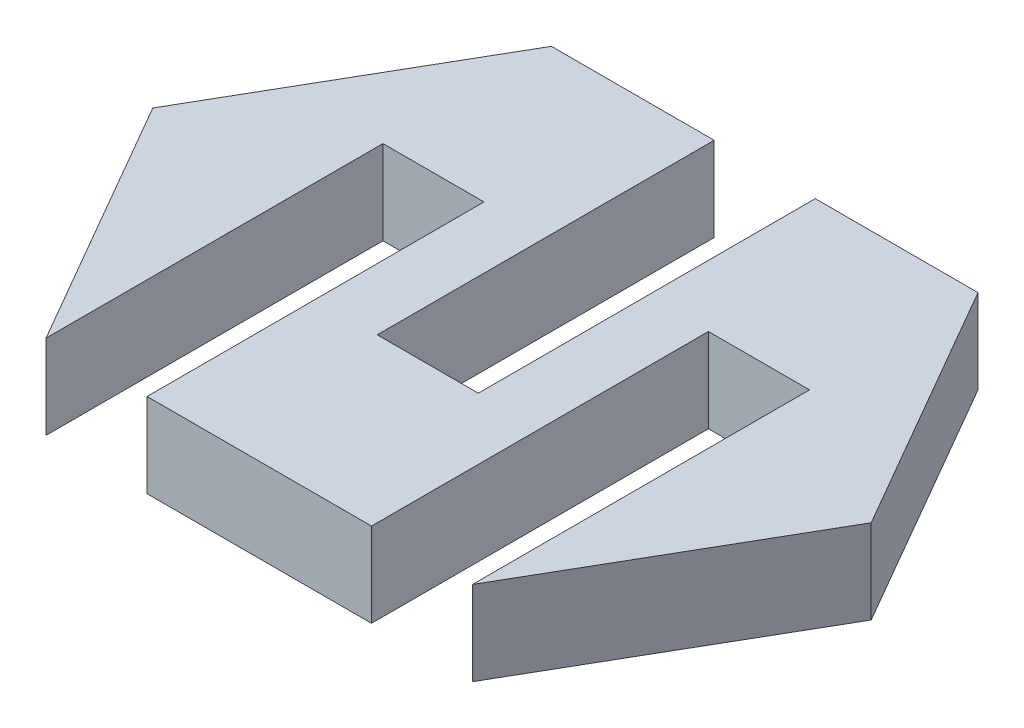
ISO-10303-21;
HEADER;
FILE_DESCRIPTION(('STEP AP214'),'2;1');
FILE_NAME('part.step','',(''),(''),'','','');
FILE_SCHEMA(('AUTOMOTIVE_DESIGN { 1 0 10303 214 1 1 1 1 }'));
ENDSEC;
DATA;
#1=APPLICATION_CONTEXT('core data for automotive mechanical design processes');
#2=APPLICATION_PROTOCOL_DEFINITION('international standard','automotive_design',2000,#1);
#3=PRODUCT_CONTEXT('',#1,'mechanical');
#4=PRODUCT('Part','Part','',(#3));
#5=PRODUCT_RELATED_PRODUCT_CATEGORY('part','',(#4));
#6=PRODUCT_DEFINITION_FORMATION('','',#4);
#7=PRODUCT_DEFINITION_CONTEXT('part definition',#1,'design');
#8=PRODUCT_DEFINITION('design','',#6,#7);
#9=PRODUCT_DEFINITION_SHAPE('','',#8);
#10=(LENGTH_UNIT() NAMED_UNIT(*) SI_UNIT(.MILLI.,.METRE.));
#11=(NAMED_UNIT(*) PLANE_ANGLE_UNIT() SI_UNIT($,.RADIAN.));
#12=(NAMED_UNIT(*) SI_UNIT($,.STERADIAN.) SOLID_ANGLE_UNIT());
#13=UNCERTAINTY_MEASURE_WITH_UNIT(LENGTH_MEASURE(1.E-05),#10,'distance_accuracy_value','');
#14=(GEOMETRIC_REPRESENTATION_CONTEXT(3) GLOBAL_UNCERTAINTY_ASSIGNED_CONTEXT((#13)) GLOBAL_UNIT_ASSIGNED_CONTEXT((#10,
#11,#12)) REPRESENTATION_CONTEXT('',''));
#15=CARTESIAN_POINT('',(0.,0.,0.));
#16=DIRECTION('',(0.,0.,1.));
#17=DIRECTION('',(1.,0.,0.));
#18=AXIS2_PLACEMENT_3D('',#15,#16,#17);
#19=CARTESIAN_POINT('',(4.2511833424019,2.5,-7.49062495930957));
#20=DIRECTION('',(0.,0.,1.));
#21=DIRECTION('',(1.,0.,0.));
#22=AXIS2_PLACEMENT_3D('',#19,#20,#21);
#23=PLANE('',#22);
#24=DIRECTION('',(-1.,0.,0.));
#25=VECTOR('',#24,1.);
#26=CARTESIAN_POINT('',(4.2511833424019,0.,-7.49062495930957));
#27=LINE('',#26,#25);
#28=CARTESIAN_POINT('',(4.2511833424019,0.,-7.49062495930957));
#29=VERTEX_POINT('',#28);
#30=CARTESIAN_POINT('',(-0.578816657598096,0.,-7.49062495930957));
#31=VERTEX_POINT('',#30);
#32=EDGE_CURVE('E279',#29,#31,#27,.T.);
#33=ORIENTED_EDGE('',*,*,#32,.T.);
#34=DIRECTION('',(0.,-1.,0.));
#35=VECTOR('',#34,1.);
#36=CARTESIAN_POINT('',(-0.578816657598096,2.5,-7.49062495930957));
#37=LINE('',#36,#35);
#38=CARTESIAN_POINT('',(-0.578816657598096,2.5,-7.49062495930957));
#39=VERTEX_POINT('',#38);
#40=EDGE_CURVE('E317',#39,#31,#37,.T.);
#41=ORIENTED_EDGE('',*,*,#40,.F.);
#42=DIRECTION('',(-1.,0.,0.));
#43=VECTOR('',#42,1.);
#44=CARTESIAN_POINT('',(4.2511833424019,2.5,-7.49062495930957));
#45=LINE('',#44,#43);
#46=CARTESIAN_POINT('',(4.2511833424019,2.5,-7.49062495930957));
#47=VERTEX_POINT('',#46);
#48=EDGE_CURVE('E257',#47,#39,#45,.T.);
#49=ORIENTED_EDGE('',*,*,#48,.F.);
#50=DIRECTION('',(0.,-1.,0.));
#51=VECTOR('',#50,1.);
#52=CARTESIAN_POINT('',(4.2511833424019,2.5,-7.49062495930957));
#53=LINE('',#52,#51);
#54=EDGE_CURVE('E48',#47,#29,#53,.T.);
#55=ORIENTED_EDGE('',*,*,#54,.T.);
#56=EDGE_LOOP('',(#33,#41,#49,#55));
#57=FACE_BOUND('',#56,.T.);
#58=ADVANCED_FACE('F39',(#57),#23,.F.);
#59=CARTESIAN_POINT('',(4.25118334240191,2.5,7.50937504069043));
#60=DIRECTION('',(-0.866025403784438,0.,-0.5));
#61=DIRECTION('',(-0.5,0.,0.866025403784438));
#62=AXIS2_PLACEMENT_3D('',#59,#60,#61);
#63=PLANE('',#62);
#64=DIRECTION('',(0.5,0.,-0.866025403784438));
#65=VECTOR('',#64,1.);
#66=CARTESIAN_POINT('',(4.25118334240191,0.,7.50937504069043));
#67=LINE('',#66,#65);
#68=CARTESIAN_POINT('',(4.25118334240191,0.,7.50937504069043));
#69=VERTEX_POINT('',#68);
#70=CARTESIAN_POINT('',(8.58131036132411,0.,0.00937504069043324));
#71=VERTEX_POINT('',#70);
#72=EDGE_CURVE('E237',#69,#71,#67,.T.);
#73=ORIENTED_EDGE('',*,*,#72,.T.);
#74=DIRECTION('',(0.,-1.,0.));
#75=VECTOR('',#74,1.);
#76=CARTESIAN_POINT('',(8.58131036132411,2.5,0.00937504069043324));
#77=LINE('',#76,#75);
#78=CARTESIAN_POINT('',(8.58131036132411,2.5,0.00937504069043324));
#79=VERTEX_POINT('',#78);
#80=EDGE_CURVE('E11',#79,#71,#77,.T.);
#81=ORIENTED_EDGE('',*,*,#80,.F.);
#82=DIRECTION('',(0.5,0.,-0.866025403784438));
#83=VECTOR('',#82,1.);
#84=CARTESIAN_POINT('',(4.25118334240191,2.5,7.50937504069043));
#85=LINE('',#84,#83);
#86=CARTESIAN_POINT('',(4.25118334240191,2.5,7.50937504069043));
#87=VERTEX_POINT('',#86);
#88=EDGE_CURVE('E248',#87,#79,#85,.T.);
#89=ORIENTED_EDGE('',*,*,#88,.F.);
#90=DIRECTION('',(0.,-1.,0.));
#91=VECTOR('',#90,1.);
#92=CARTESIAN_POINT('',(4.25118334240191,2.5,7.50937504069043));
#93=LINE('',#92,#91);
#94=EDGE_CURVE('E272',#87,#69,#93,.T.);
#95=ORIENTED_EDGE('',*,*,#94,.T.);
#96=EDGE_LOOP('',(#73,#81,#89,#95));
#97=FACE_BOUND('',#96,.T.);
#98=ADVANCED_FACE('F41',(#97),#63,.F.);
#99=CARTESIAN_POINT('',(8.58131036132411,2.5,0.00937504069043324));
#100=DIRECTION('',(-0.866025403784438,0.,0.5));
#101=DIRECTION('',(0.5,0.,0.866025403784438));
#102=AXIS2_PLACEMENT_3D('',#99,#100,#101);
#103=PLANE('',#102);
#104=DIRECTION('',(-0.5,0.,-0.866025403784438));
#105=VECTOR('',#104,1.);
#106=CARTESIAN_POINT('',(8.58131036132411,0.,0.00937504069043324));
#107=LINE('',#106,#105);
#108=EDGE_CURVE('E276',#71,#29,#107,.T.);
#109=ORIENTED_EDGE('',*,*,#108,.T.);
#110=ORIENTED_EDGE('',*,*,#54,.F.);
#111=DIRECTION('',(-0.5,0.,-0.866025403784438));
#112=VECTOR('',#111,1.);
#113=CARTESIAN_POINT('',(8.58131036132411,2.5,0.00937504069043324));
#114=LINE('',#113,#112);
#115=EDGE_CURVE('E252',#79,#47,#114,.T.);
#116=ORIENTED_EDGE('',*,*,#115,.F.);
#117=ORIENTED_EDGE('',*,*,#80,.T.);
#118=EDGE_LOOP('',(#109,#110,#116,#117));
#119=FACE_BOUND('',#118,.T.);
#120=ADVANCED_FACE('F371',(#119),#103,.F.);
#121=CARTESIAN_POINT('',(-3.5788166575981,2.5,-7.49062495930957));
#122=VERTEX_POINT('',#121);
#123=CARTESIAN_POINT('',(-8.40907069544247,2.5,-7.49062495930957));
#124=VERTEX_POINT('',#123);
#125=EDGE_CURVE('E256',#122,#124,#45,.T.);
#126=ORIENTED_EDGE('',*,*,#125,.F.);
#127=DIRECTION('',(0.,1.,0.));
#128=VECTOR('',#127,1.);
#129=CARTESIAN_POINT('',(-3.5788166575981,2.5,-7.49062495930957));
#130=LINE('',#129,#128);
#131=CARTESIAN_POINT('',(-3.5788166575981,0.,-7.49062495930957));
#132=VERTEX_POINT('',#131);
#133=EDGE_CURVE('E320',#132,#122,#130,.T.);
#134=ORIENTED_EDGE('',*,*,#133,.F.);
#135=CARTESIAN_POINT('',(-8.40907069544247,0.,-7.49062495930957));
#136=VERTEX_POINT('',#135);
#137=EDGE_CURVE('E175',#132,#136,#27,.T.);
#138=ORIENTED_EDGE('',*,*,#137,.T.);
#139=DIRECTION('',(0.,-1.,0.));
#140=VECTOR('',#139,1.);
#141=CARTESIAN_POINT('',(-8.40907069544247,2.5,-7.49062495930957));
#142=LINE('',#141,#140);
#143=EDGE_CURVE('E303',#124,#136,#142,.T.);
#144=ORIENTED_EDGE('',*,*,#143,.F.);
#145=EDGE_LOOP('',(#126,#134,#138,#144));
#146=FACE_BOUND('',#145,.T.);
#147=ADVANCED_FACE('F335',(#146),#23,.F.);
#148=CARTESIAN_POINT('',(-8.40907069544247,2.5,-7.49062495930957));
#149=DIRECTION('',(0.866025403784439,0.,0.5));
#150=DIRECTION('',(0.5,0.,-0.866025403784439));
#151=AXIS2_PLACEMENT_3D('',#148,#149,#150);
#152=PLANE('',#151);
#153=DIRECTION('',(-0.5,0.,0.866025403784439));
#154=VECTOR('',#153,1.);
#155=CARTESIAN_POINT('',(-8.40907069544247,0.,-7.49062495930957));
#156=LINE('',#155,#154);
#157=CARTESIAN_POINT('',(-12.7391977143647,0.,0.00937504069042916));
#158=VERTEX_POINT('',#157);
#159=EDGE_CURVE('E283',#136,#158,#156,.T.);
#160=ORIENTED_EDGE('',*,*,#159,.T.);
#161=DIRECTION('',(0.,-1.,0.));
#162=VECTOR('',#161,1.);
#163=CARTESIAN_POINT('',(-12.7391977143647,2.5,0.00937504069042916));
#164=LINE('',#163,#162);
#165=CARTESIAN_POINT('',(-12.7391977143647,2.5,0.00937504069042916));
#166=VERTEX_POINT('',#165);
#167=EDGE_CURVE('E299',#166,#158,#164,.T.);
#168=ORIENTED_EDGE('',*,*,#167,.F.);
#169=DIRECTION('',(-0.5,0.,0.866025403784439));
#170=VECTOR('',#169,1.);
#171=CARTESIAN_POINT('',(-8.40907069544247,2.5,-7.49062495930957));
#172=LINE('',#171,#170);
#173=EDGE_CURVE('E261',#124,#166,#172,.T.);
#174=ORIENTED_EDGE('',*,*,#173,.F.);
#175=ORIENTED_EDGE('',*,*,#143,.T.);
#176=EDGE_LOOP('',(#160,#168,#174,#175));
#177=FACE_BOUND('',#176,.T.);
#178=ADVANCED_FACE('F337',(#177),#152,.F.);
#179=CARTESIAN_POINT('',(-12.7391977143647,2.5,0.00937504069042916));
#180=DIRECTION('',(0.866025403784439,0.,-0.5));
#181=DIRECTION('',(-0.5,0.,-0.866025403784439));
#182=AXIS2_PLACEMENT_3D('',#179,#180,#181);
#183=PLANE('',#182);
#184=DIRECTION('',(0.5,0.,0.866025403784439));
#185=VECTOR('',#184,1.);
#186=CARTESIAN_POINT('',(-12.7391977143647,0.,0.00937504069042916));
#187=LINE('',#186,#185);
#188=CARTESIAN_POINT('',(-8.40907069544247,0.,7.50937504069043));
#189=VERTEX_POINT('',#188);
#190=EDGE_CURVE('E286',#158,#189,#187,.T.);
#191=ORIENTED_EDGE('',*,*,#190,.T.);
#192=DIRECTION('',(0.,-1.,0.));
#193=VECTOR('',#192,1.);
#194=CARTESIAN_POINT('',(-8.40907069544247,2.5,7.50937504069043));
#195=LINE('',#194,#193);
#196=CARTESIAN_POINT('',(-8.40907069544247,2.5,7.50937504069043));
#197=VERTEX_POINT('',#196);
#198=EDGE_CURVE('E296',#197,#189,#195,.T.);
#199=ORIENTED_EDGE('',*,*,#198,.F.);
#200=DIRECTION('',(0.5,0.,0.866025403784439));
#201=VECTOR('',#200,1.);
#202=CARTESIAN_POINT('',(-12.7391977143647,2.5,0.00937504069042916));
#203=LINE('',#202,#201);
#204=EDGE_CURVE('E264',#166,#197,#203,.T.);
#205=ORIENTED_EDGE('',*,*,#204,.F.);
#206=ORIENTED_EDGE('',*,*,#167,.T.);
#207=EDGE_LOOP('',(#191,#199,#205,#206));
#208=FACE_BOUND('',#207,.T.);
#209=ADVANCED_FACE('F342',(#208),#183,.F.);
#210=CARTESIAN_POINT('',(-8.40907069544247,2.5,7.50937504069043));
#211=DIRECTION('',(0.,0.,-1.));
#212=DIRECTION('',(-1.,0.,0.));
#213=AXIS2_PLACEMENT_3D('',#210,#211,#212);
#214=PLANE('',#213);
#215=DIRECTION('',(1.,0.,0.));
#216=VECTOR('',#215,1.);
#217=CARTESIAN_POINT('',(-8.40907069544247,0.,7.50937504069043));
#218=LINE('',#217,#216);
#219=CARTESIAN_POINT('',(-5.40907069544248,0.,7.50937504069043));
#220=VERTEX_POINT('',#219);
#221=CARTESIAN_POINT('',(1.25118334240191,0.,7.50937504069043));
#222=VERTEX_POINT('',#221);
#223=EDGE_CURVE('E253',#220,#222,#218,.T.);
#224=ORIENTED_EDGE('',*,*,#223,.T.);
#225=DIRECTION('',(0.,-1.,0.));
#226=VECTOR('',#225,1.);
#227=CARTESIAN_POINT('',(1.25118334240191,0.,7.50937504069043));
#228=LINE('',#227,#226);
#229=CARTESIAN_POINT('',(1.25118334240191,2.5,7.50937504069043));
#230=VERTEX_POINT('',#229);
#231=EDGE_CURVE('E191',#230,#222,#228,.T.);
#232=ORIENTED_EDGE('',*,*,#231,.F.);
#233=DIRECTION('',(1.,0.,0.));
#234=VECTOR('',#233,1.);
#235=CARTESIAN_POINT('',(-8.40907069544247,2.5,7.50937504069043));
#236=LINE('',#235,#234);
#237=CARTESIAN_POINT('',(-5.40907069544248,2.5,7.50937504069043));
#238=VERTEX_POINT('',#237);
#239=EDGE_CURVE('E268',#238,#230,#236,.T.);
#240=ORIENTED_EDGE('',*,*,#239,.F.);
#241=DIRECTION('',(0.,1.,0.));
#242=VECTOR('',#241,1.);
#243=CARTESIAN_POINT('',(-5.40907069544248,0.,7.50937504069043));
#244=LINE('',#243,#242);
#245=EDGE_CURVE('E205',#220,#238,#244,.T.);
#246=ORIENTED_EDGE('',*,*,#245,.F.);
#247=EDGE_LOOP('',(#224,#232,#240,#246));
#248=FACE_BOUND('',#247,.T.);
#249=ADVANCED_FACE('F359',(#248),#214,.F.);
#250=CARTESIAN_POINT('',(0.,2.5,0.));
#251=DIRECTION('',(0.,1.,0.));
#252=DIRECTION('',(0.,0.,1.));
#253=AXIS2_PLACEMENT_3D('',#250,#251,#252);
#254=PLANE('',#253);
#255=DIRECTION('',(0.,0.,-1.));
#256=VECTOR('',#255,1.);
#257=CARTESIAN_POINT('',(-0.578816657598096,2.5,2.50937504069043));
#258=LINE('',#257,#256);
#259=CARTESIAN_POINT('',(-0.578816657598096,2.5,2.50937504069043));
#260=VERTEX_POINT('',#259);
#261=EDGE_CURVE('E181',#260,#39,#258,.T.);
#262=ORIENTED_EDGE('',*,*,#261,.F.);
#263=DIRECTION('',(1.,0.,0.));
#264=VECTOR('',#263,1.);
#265=CARTESIAN_POINT('',(-0.578816657598096,2.5,2.50937504069043));
#266=LINE('',#265,#264);
#267=CARTESIAN_POINT('',(-3.5788166575981,2.5,2.50937504069043));
#268=VERTEX_POINT('',#267);
#269=EDGE_CURVE('E163',#268,#260,#266,.T.);
#270=ORIENTED_EDGE('',*,*,#269,.F.);
#271=DIRECTION('',(0.,0.,-1.));
#272=VECTOR('',#271,1.);
#273=CARTESIAN_POINT('',(-3.5788166575981,2.5,2.50937504069043));
#274=LINE('',#273,#272);
#275=EDGE_CURVE('E160',#268,#122,#274,.T.);
#276=ORIENTED_EDGE('',*,*,#275,.T.);
#277=ORIENTED_EDGE('',*,*,#125,.T.);
#278=ORIENTED_EDGE('',*,*,#173,.T.);
#279=ORIENTED_EDGE('',*,*,#204,.T.);
#280=DIRECTION('',(0.,0.,1.));
#281=VECTOR('',#280,1.);
#282=CARTESIAN_POINT('',(-8.40907069544247,2.5,-2.49062495930957));
#283=LINE('',#282,#281);
#284=CARTESIAN_POINT('',(-8.40907069544247,2.5,-2.49062495930957));
#285=VERTEX_POINT('',#284);
#286=EDGE_CURVE('E234',#285,#197,#283,.T.);
#287=ORIENTED_EDGE('',*,*,#286,.F.);
#288=DIRECTION('',(-1.,0.,0.));
#289=VECTOR('',#288,1.);
#290=CARTESIAN_POINT('',(-8.40907069544247,2.5,-2.49062495930957));
#291=LINE('',#290,#289);
#292=CARTESIAN_POINT('',(-5.40907069544248,2.5,-2.49062495930957));
#293=VERTEX_POINT('',#292);
#294=EDGE_CURVE('E227',#293,#285,#291,.T.);
#295=ORIENTED_EDGE('',*,*,#294,.F.);
#296=DIRECTION('',(0.,0.,1.));
#297=VECTOR('',#296,1.);
#298=CARTESIAN_POINT('',(-5.40907069544248,2.5,-2.49062495930957));
#299=LINE('',#298,#297);
#300=EDGE_CURVE('E238',#293,#238,#299,.T.);
#301=ORIENTED_EDGE('',*,*,#300,.T.);
#302=ORIENTED_EDGE('',*,*,#239,.T.);
#303=DIRECTION('',(0.,0.,1.));
#304=VECTOR('',#303,1.);
#305=CARTESIAN_POINT('',(1.25118334240191,2.5,-2.49062495930957));
#306=LINE('',#305,#304);
#307=CARTESIAN_POINT('',(1.25118334240191,2.5,-2.49062495930957));
#308=VERTEX_POINT('',#307);
#309=EDGE_CURVE('E210',#308,#230,#306,.T.);
#310=ORIENTED_EDGE('',*,*,#309,.F.);
#311=DIRECTION('',(-1.,0.,0.));
#312=VECTOR('',#311,1.);
#313=CARTESIAN_POINT('',(4.25118334240191,2.5,-2.49062495930957));
#314=LINE('',#313,#312);
#315=CARTESIAN_POINT('',(4.25118334240191,2.5,-2.49062495930957));
#316=VERTEX_POINT('',#315);
#317=EDGE_CURVE('E190',#316,#308,#314,.T.);
#318=ORIENTED_EDGE('',*,*,#317,.F.);
#319=DIRECTION('',(0.,0.,1.));
#320=VECTOR('',#319,1.);
#321=CARTESIAN_POINT('',(4.25118334240191,2.5,-2.49062495930957));
#322=LINE('',#321,#320);
#323=EDGE_CURVE('E199',#316,#87,#322,.T.);
#324=ORIENTED_EDGE('',*,*,#323,.T.);
#325=ORIENTED_EDGE('',*,*,#88,.T.);
#326=ORIENTED_EDGE('',*,*,#115,.T.);
#327=ORIENTED_EDGE('',*,*,#48,.T.);
#328=EDGE_LOOP('',(#262,#270,#276,#277,#278,#279,#287,#295,#301,#302,#310,#318,#324,#325,#326,#327));
#329=FACE_BOUND('',#328,.T.);
#330=ADVANCED_FACE('F331',(#329),#254,.T.);
#331=CARTESIAN_POINT('',(0.,0.,0.));
#332=DIRECTION('',(0.,1.,0.));
#333=DIRECTION('',(0.,0.,1.));
#334=AXIS2_PLACEMENT_3D('',#331,#332,#333);
#335=PLANE('',#334);
#336=DIRECTION('',(-1.,0.,0.));
#337=VECTOR('',#336,1.);
#338=CARTESIAN_POINT('',(-0.578816657598096,0.,2.50937504069043));
#339=LINE('',#338,#337);
#340=CARTESIAN_POINT('',(-0.578816657598096,0.,2.50937504069043));
#341=VERTEX_POINT('',#340);
#342=CARTESIAN_POINT('',(-3.5788166575981,0.,2.50937504069043));
#343=VERTEX_POINT('',#342);
#344=EDGE_CURVE('E164',#341,#343,#339,.T.);
#345=ORIENTED_EDGE('',*,*,#344,.F.);
#346=DIRECTION('',(0.,0.,-1.));
#347=VECTOR('',#346,1.);
#348=CARTESIAN_POINT('',(-0.578816657598096,0.,2.50937504069043));
#349=LINE('',#348,#347);
#350=EDGE_CURVE('E177',#341,#31,#349,.T.);
#351=ORIENTED_EDGE('',*,*,#350,.T.);
#352=ORIENTED_EDGE('',*,*,#32,.F.);
#353=ORIENTED_EDGE('',*,*,#108,.F.);
#354=ORIENTED_EDGE('',*,*,#72,.F.);
#355=DIRECTION('',(0.,0.,1.));
#356=VECTOR('',#355,1.);
#357=CARTESIAN_POINT('',(4.25118334240191,0.,-2.49062495930957));
#358=LINE('',#357,#356);
#359=CARTESIAN_POINT('',(4.25118334240191,0.,-2.49062495930957));
#360=VERTEX_POINT('',#359);
#361=EDGE_CURVE('E202',#360,#69,#358,.T.);
#362=ORIENTED_EDGE('',*,*,#361,.F.);
#363=DIRECTION('',(1.,0.,0.));
#364=VECTOR('',#363,1.);
#365=CARTESIAN_POINT('',(4.25118334240191,0.,-2.49062495930957));
#366=LINE('',#365,#364);
#367=CARTESIAN_POINT('',(1.25118334240191,0.,-2.49062495930957));
#368=VERTEX_POINT('',#367);
#369=EDGE_CURVE('E196',#368,#360,#366,.T.);
#370=ORIENTED_EDGE('',*,*,#369,.F.);
#371=DIRECTION('',(0.,0.,1.));
#372=VECTOR('',#371,1.);
#373=CARTESIAN_POINT('',(1.25118334240191,0.,-2.49062495930957));
#374=LINE('',#373,#372);
#375=EDGE_CURVE('E206',#368,#222,#374,.T.);
#376=ORIENTED_EDGE('',*,*,#375,.T.);
#377=ORIENTED_EDGE('',*,*,#223,.F.);
#378=DIRECTION('',(0.,0.,1.));
#379=VECTOR('',#378,1.);
#380=CARTESIAN_POINT('',(-5.40907069544248,0.,-2.49062495930957));
#381=LINE('',#380,#379);
#382=CARTESIAN_POINT('',(-5.40907069544248,0.,-2.49062495930957));
#383=VERTEX_POINT('',#382);
#384=EDGE_CURVE('E242',#383,#220,#381,.T.);
#385=ORIENTED_EDGE('',*,*,#384,.F.);
#386=DIRECTION('',(1.,0.,0.));
#387=VECTOR('',#386,1.);
#388=CARTESIAN_POINT('',(-8.40907069544247,0.,-2.49062495930957));
#389=LINE('',#388,#387);
#390=CARTESIAN_POINT('',(-8.40907069544247,0.,-2.49062495930957));
#391=VERTEX_POINT('',#390);
#392=EDGE_CURVE('E219',#391,#383,#389,.T.);
#393=ORIENTED_EDGE('',*,*,#392,.F.);
#394=DIRECTION('',(0.,0.,1.));
#395=VECTOR('',#394,1.);
#396=CARTESIAN_POINT('',(-8.40907069544247,0.,-2.49062495930957));
#397=LINE('',#396,#395);
#398=EDGE_CURVE('E231',#391,#189,#397,.T.);
#399=ORIENTED_EDGE('',*,*,#398,.T.);
#400=ORIENTED_EDGE('',*,*,#190,.F.);
#401=ORIENTED_EDGE('',*,*,#159,.F.);
#402=ORIENTED_EDGE('',*,*,#137,.F.);
#403=DIRECTION('',(0.,0.,-1.));
#404=VECTOR('',#403,1.);
#405=CARTESIAN_POINT('',(-3.5788166575981,0.,2.50937504069043));
#406=LINE('',#405,#404);
#407=EDGE_CURVE('E157',#343,#132,#406,.T.);
#408=ORIENTED_EDGE('',*,*,#407,.F.);
#409=EDGE_LOOP('',(#345,#351,#352,#353,#354,#362,#370,#376,#377,#385,#393,#399,#400,#401,#402,#408));
#410=FACE_BOUND('',#409,.T.);
#411=ADVANCED_FACE('F173',(#410),#335,.F.);
#412=CARTESIAN_POINT('',(-8.40907069544247,0.,-2.49062495930957));
#413=DIRECTION('',(-1.,0.,0.));
#414=DIRECTION('',(0.,0.,1.));
#415=AXIS2_PLACEMENT_3D('',#412,#413,#414);
#416=PLANE('',#415);
#417=ORIENTED_EDGE('',*,*,#198,.T.);
#418=ORIENTED_EDGE('',*,*,#398,.F.);
#419=DIRECTION('',(0.,-1.,0.));
#420=VECTOR('',#419,1.);
#421=CARTESIAN_POINT('',(-8.40907069544247,0.,-2.49062495930957));
#422=LINE('',#421,#420);
#423=EDGE_CURVE('E216',#285,#391,#422,.T.);
#424=ORIENTED_EDGE('',*,*,#423,.F.);
#425=ORIENTED_EDGE('',*,*,#286,.T.);
#426=EDGE_LOOP('',(#417,#418,#424,#425));
#427=FACE_BOUND('',#426,.T.);
#428=ADVANCED_FACE('F346',(#427),#416,.F.);
#429=CARTESIAN_POINT('',(-5.40907069544248,0.,-2.49062495930957));
#430=DIRECTION('',(1.,0.,0.));
#431=DIRECTION('',(0.,0.,-1.));
#432=AXIS2_PLACEMENT_3D('',#429,#430,#431);
#433=PLANE('',#432);
#434=ORIENTED_EDGE('',*,*,#245,.T.);
#435=ORIENTED_EDGE('',*,*,#300,.F.);
#436=DIRECTION('',(0.,1.,0.));
#437=VECTOR('',#436,1.);
#438=CARTESIAN_POINT('',(-5.40907069544248,0.,-2.49062495930957));
#439=LINE('',#438,#437);
#440=EDGE_CURVE('E223',#383,#293,#439,.T.);
#441=ORIENTED_EDGE('',*,*,#440,.F.);
#442=ORIENTED_EDGE('',*,*,#384,.T.);
#443=EDGE_LOOP('',(#434,#435,#441,#442));
#444=FACE_BOUND('',#443,.T.);
#445=ADVANCED_FACE('F353',(#444),#433,.F.);
#446=CARTESIAN_POINT('',(0.,0.,-2.49062495930957));
#447=DIRECTION('',(0.,0.,-1.));
#448=DIRECTION('',(-1.,0.,0.));
#449=AXIS2_PLACEMENT_3D('',#446,#447,#448);
#450=PLANE('',#449);
#451=ORIENTED_EDGE('',*,*,#423,.T.);
#452=ORIENTED_EDGE('',*,*,#392,.T.);
#453=ORIENTED_EDGE('',*,*,#440,.T.);
#454=ORIENTED_EDGE('',*,*,#294,.T.);
#455=EDGE_LOOP('',(#451,#452,#453,#454));
#456=FACE_BOUND('',#455,.T.);
#457=ADVANCED_FACE('F350',(#456),#450,.F.);
#458=CARTESIAN_POINT('',(4.25118334240191,0.,-2.49062495930957));
#459=DIRECTION('',(1.,0.,0.));
#460=DIRECTION('',(0.,0.,-1.));
#461=AXIS2_PLACEMENT_3D('',#458,#459,#460);
#462=PLANE('',#461);
#463=ORIENTED_EDGE('',*,*,#94,.F.);
#464=ORIENTED_EDGE('',*,*,#323,.F.);
#465=DIRECTION('',(0.,1.,0.));
#466=VECTOR('',#465,1.);
#467=CARTESIAN_POINT('',(4.25118334240191,0.,-2.49062495930957));
#468=LINE('',#467,#466);
#469=EDGE_CURVE('E186',#360,#316,#468,.T.);
#470=ORIENTED_EDGE('',*,*,#469,.F.);
#471=ORIENTED_EDGE('',*,*,#361,.T.);
#472=EDGE_LOOP('',(#463,#464,#470,#471));
#473=FACE_BOUND('',#472,.T.);
#474=ADVANCED_FACE('F401',(#473),#462,.F.);
#475=CARTESIAN_POINT('',(1.25118334240191,0.,-2.49062495930957));
#476=DIRECTION('',(-1.,0.,0.));
#477=DIRECTION('',(0.,0.,1.));
#478=AXIS2_PLACEMENT_3D('',#475,#476,#477);
#479=PLANE('',#478);
#480=ORIENTED_EDGE('',*,*,#231,.T.);
#481=ORIENTED_EDGE('',*,*,#375,.F.);
#482=DIRECTION('',(0.,-1.,0.));
#483=VECTOR('',#482,1.);
#484=CARTESIAN_POINT('',(1.25118334240191,0.,-2.49062495930957));
#485=LINE('',#484,#483);
#486=EDGE_CURVE('E63',#308,#368,#485,.T.);
#487=ORIENTED_EDGE('',*,*,#486,.F.);
#488=ORIENTED_EDGE('',*,*,#309,.T.);
#489=EDGE_LOOP('',(#480,#481,#487,#488));
#490=FACE_BOUND('',#489,.T.);
#491=ADVANCED_FACE('F362',(#490),#479,.F.);
#492=CARTESIAN_POINT('',(0.,0.,-2.49062495930957));
#493=DIRECTION('',(0.,0.,1.));
#494=DIRECTION('',(1.,0.,0.));
#495=AXIS2_PLACEMENT_3D('',#492,#493,#494);
#496=PLANE('',#495);
#497=ORIENTED_EDGE('',*,*,#469,.T.);
#498=ORIENTED_EDGE('',*,*,#317,.T.);
#499=ORIENTED_EDGE('',*,*,#486,.T.);
#500=ORIENTED_EDGE('',*,*,#369,.T.);
#501=EDGE_LOOP('',(#497,#498,#499,#500));
#502=FACE_BOUND('',#501,.T.);
#503=ADVANCED_FACE('F365',(#502),#496,.T.);
#504=CARTESIAN_POINT('',(-0.578816657598096,2.5,2.50937504069043));
#505=DIRECTION('',(1.,0.,0.));
#506=DIRECTION('',(0.,1.,0.));
#507=AXIS2_PLACEMENT_3D('',#504,#505,#506);
#508=PLANE('',#507);
#509=ORIENTED_EDGE('',*,*,#40,.T.);
#510=ORIENTED_EDGE('',*,*,#350,.F.);
#511=DIRECTION('',(0.,-1.,0.));
#512=VECTOR('',#511,1.);
#513=CARTESIAN_POINT('',(-0.578816657598096,2.5,2.50937504069043));
#514=LINE('',#513,#512);
#515=EDGE_CURVE('E55',#260,#341,#514,.T.);
#516=ORIENTED_EDGE('',*,*,#515,.F.);
#517=ORIENTED_EDGE('',*,*,#261,.T.);
#518=EDGE_LOOP('',(#509,#510,#516,#517));
#519=FACE_BOUND('',#518,.T.);
#520=ADVANCED_FACE('F316',(#519),#508,.F.);
#521=CARTESIAN_POINT('',(-3.5788166575981,2.5,2.50937504069043));
#522=DIRECTION('',(-1.,0.,0.));
#523=DIRECTION('',(0.,0.,1.));
#524=AXIS2_PLACEMENT_3D('',#521,#522,#523);
#525=PLANE('',#524);
#526=ORIENTED_EDGE('',*,*,#133,.T.);
#527=ORIENTED_EDGE('',*,*,#275,.F.);
#528=DIRECTION('',(0.,1.,0.));
#529=VECTOR('',#528,1.);
#530=CARTESIAN_POINT('',(-3.5788166575981,2.5,2.50937504069043));
#531=LINE('',#530,#529);
#532=EDGE_CURVE('E154',#343,#268,#531,.T.);
#533=ORIENTED_EDGE('',*,*,#532,.F.);
#534=ORIENTED_EDGE('',*,*,#407,.T.);
#535=EDGE_LOOP('',(#526,#527,#533,#534));
#536=FACE_BOUND('',#535,.T.);
#537=ADVANCED_FACE('F155',(#536),#525,.F.);
#538=CARTESIAN_POINT('',(0.,0.,2.50937504069043));
#539=DIRECTION('',(0.,0.,-1.));
#540=DIRECTION('',(-1.,0.,0.));
#541=AXIS2_PLACEMENT_3D('',#538,#539,#540);
#542=PLANE('',#541);
#543=ORIENTED_EDGE('',*,*,#515,.T.);
#544=ORIENTED_EDGE('',*,*,#344,.T.);
#545=ORIENTED_EDGE('',*,*,#532,.T.);
#546=ORIENTED_EDGE('',*,*,#269,.T.);
#547=EDGE_LOOP('',(#543,#544,#545,#546));
#548=FACE_BOUND('',#547,.T.);
#549=ADVANCED_FACE('F167',(#548),#542,.T.);
#550=CLOSED_SHELL('',(#58,#98,#120,#147,#178,#209,#249,#330,#411,#428,#445,#457,#474,#491,#503,
#520,#537,#549));
#551=MANIFOLD_SOLID_BREP('B2',#550);
#552=ADVANCED_BREP_SHAPE_REPRESENTATION('',(#18,#551),#14);
#553=SHAPE_DEFINITION_REPRESENTATION(#9,#552);
ENDSEC;
END-ISO-10303-21;
